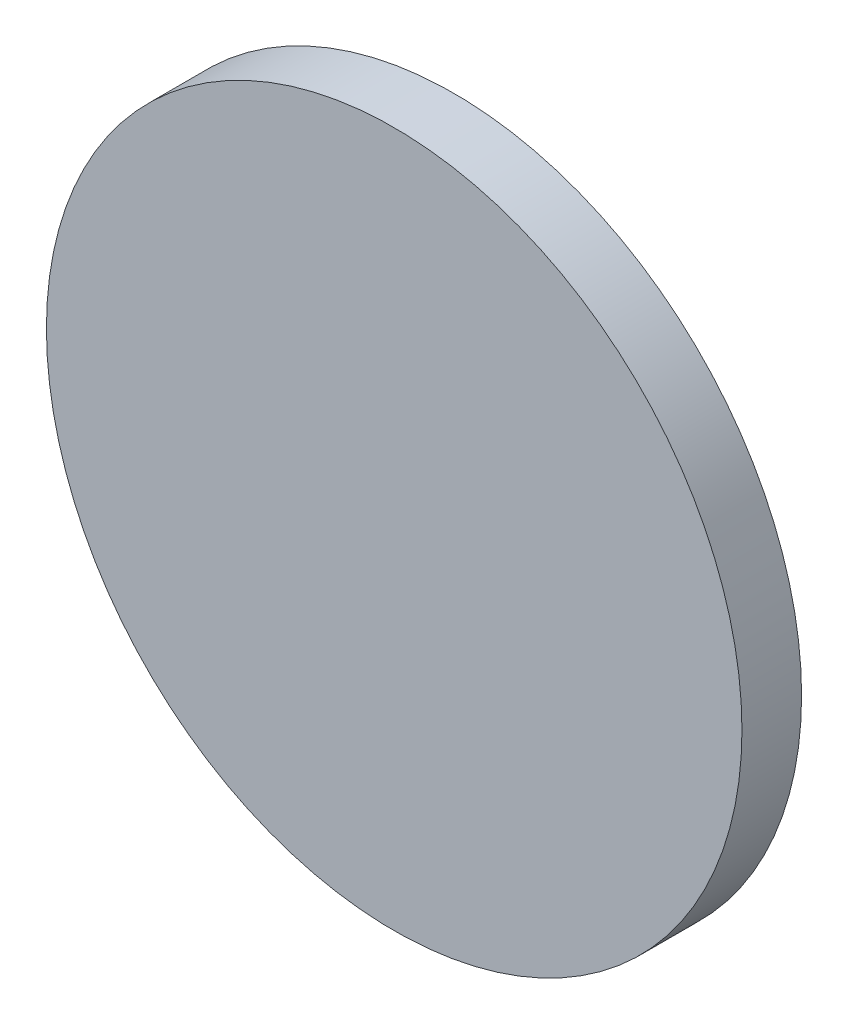
ISO-10303-21;
HEADER;
FILE_DESCRIPTION(('STEP AP214'),'2;1');
FILE_NAME('part.step','',(''),(''),'','','');
FILE_SCHEMA(('AUTOMOTIVE_DESIGN { 1 0 10303 214 1 1 1 1 }'));
ENDSEC;
DATA;
#1=APPLICATION_CONTEXT('core data for automotive mechanical design processes');
#2=APPLICATION_PROTOCOL_DEFINITION('international standard','automotive_design',2000,#1);
#3=PRODUCT_CONTEXT('',#1,'mechanical');
#4=PRODUCT('Part','Part','',(#3));
#5=PRODUCT_RELATED_PRODUCT_CATEGORY('part','',(#4));
#6=PRODUCT_DEFINITION_FORMATION('','',#4);
#7=PRODUCT_DEFINITION_CONTEXT('part definition',#1,'design');
#8=PRODUCT_DEFINITION('design','',#6,#7);
#9=PRODUCT_DEFINITION_SHAPE('','',#8);
#10=(LENGTH_UNIT() NAMED_UNIT(*) SI_UNIT(.MILLI.,.METRE.));
#11=(NAMED_UNIT(*) PLANE_ANGLE_UNIT() SI_UNIT($,.RADIAN.));
#12=(NAMED_UNIT(*) SI_UNIT($,.STERADIAN.) SOLID_ANGLE_UNIT());
#13=UNCERTAINTY_MEASURE_WITH_UNIT(LENGTH_MEASURE(1.E-05),#10,'distance_accuracy_value','');
#14=(GEOMETRIC_REPRESENTATION_CONTEXT(3) GLOBAL_UNCERTAINTY_ASSIGNED_CONTEXT((#13)) GLOBAL_UNIT_ASSIGNED_CONTEXT((#10,
#11,#12)) REPRESENTATION_CONTEXT('',''));
#15=CARTESIAN_POINT('',(0.,0.,0.));
#16=DIRECTION('',(0.,0.,1.));
#17=DIRECTION('',(1.,0.,0.));
#18=AXIS2_PLACEMENT_3D('',#15,#16,#17);
#19=CARTESIAN_POINT('',(5.6007,3.7719,0.03429));
#20=DIRECTION('',(0.,0.,1.));
#21=DIRECTION('',(1.,0.,0.));
#22=AXIS2_PLACEMENT_3D('',#19,#20,#21);
#23=PLANE('',#22);
#24=CARTESIAN_POINT('',(5.6007,3.7719,0.03429));
#25=DIRECTION('',(0.,0.,1.));
#26=DIRECTION('',(1.,0.,0.));
#27=AXIS2_PLACEMENT_3D('',#24,#25,#26);
#28=CIRCLE('',#27,0.200024667);
#29=CARTESIAN_POINT('',(5.800724667,3.7719,0.03429));
#30=VERTEX_POINT('',#29);
#31=EDGE_CURVE('E18',#30,#30,#28,.F.);
#32=ORIENTED_EDGE('',*,*,#31,.F.);
#33=EDGE_LOOP('',(#32));
#34=FACE_BOUND('',#33,.T.);
#35=ADVANCED_FACE('F15',(#34),#23,.T.);
#36=CARTESIAN_POINT('',(5.6007,3.7719,0.));
#37=DIRECTION('',(0.,0.,1.));
#38=DIRECTION('',(1.,0.,0.));
#39=AXIS2_PLACEMENT_3D('',#36,#37,#38);
#40=CYLINDRICAL_SURFACE('',#39,0.200024667);
#41=ORIENTED_EDGE('',*,*,#31,.T.);
#42=EDGE_LOOP('',(#41));
#43=FACE_BOUND('',#42,.T.);
#44=CARTESIAN_POINT('',(5.6007,3.7719,0.));
#45=DIRECTION('',(0.,0.,1.));
#46=DIRECTION('',(1.,0.,0.));
#47=AXIS2_PLACEMENT_3D('',#44,#45,#46);
#48=CIRCLE('',#47,0.200024667);
#49=CARTESIAN_POINT('',(5.800724667,3.7719,0.));
#50=VERTEX_POINT('',#49);
#51=EDGE_CURVE('E10',#50,#50,#48,.F.);
#52=ORIENTED_EDGE('',*,*,#51,.F.);
#53=EDGE_LOOP('',(#52));
#54=FACE_BOUND('',#53,.T.);
#55=ADVANCED_FACE('F27',(#43,#54),#40,.T.);
#56=CARTESIAN_POINT('',(5.6007,3.7719,0.));
#57=DIRECTION('',(0.,0.,-1.));
#58=DIRECTION('',(-1.,0.,0.));
#59=AXIS2_PLACEMENT_3D('',#56,#57,#58);
#60=PLANE('',#59);
#61=ORIENTED_EDGE('',*,*,#51,.T.);
#62=EDGE_LOOP('',(#61));
#63=FACE_BOUND('',#62,.T.);
#64=ADVANCED_FACE('F35',(#63),#60,.T.);
#65=CLOSED_SHELL('',(#35,#55,#64));
#66=MANIFOLD_SOLID_BREP('B1',#65);
#67=ADVANCED_BREP_SHAPE_REPRESENTATION('',(#18,#66),#14);
#68=SHAPE_DEFINITION_REPRESENTATION(#9,#67);
ENDSEC;
END-ISO-10303-21;
